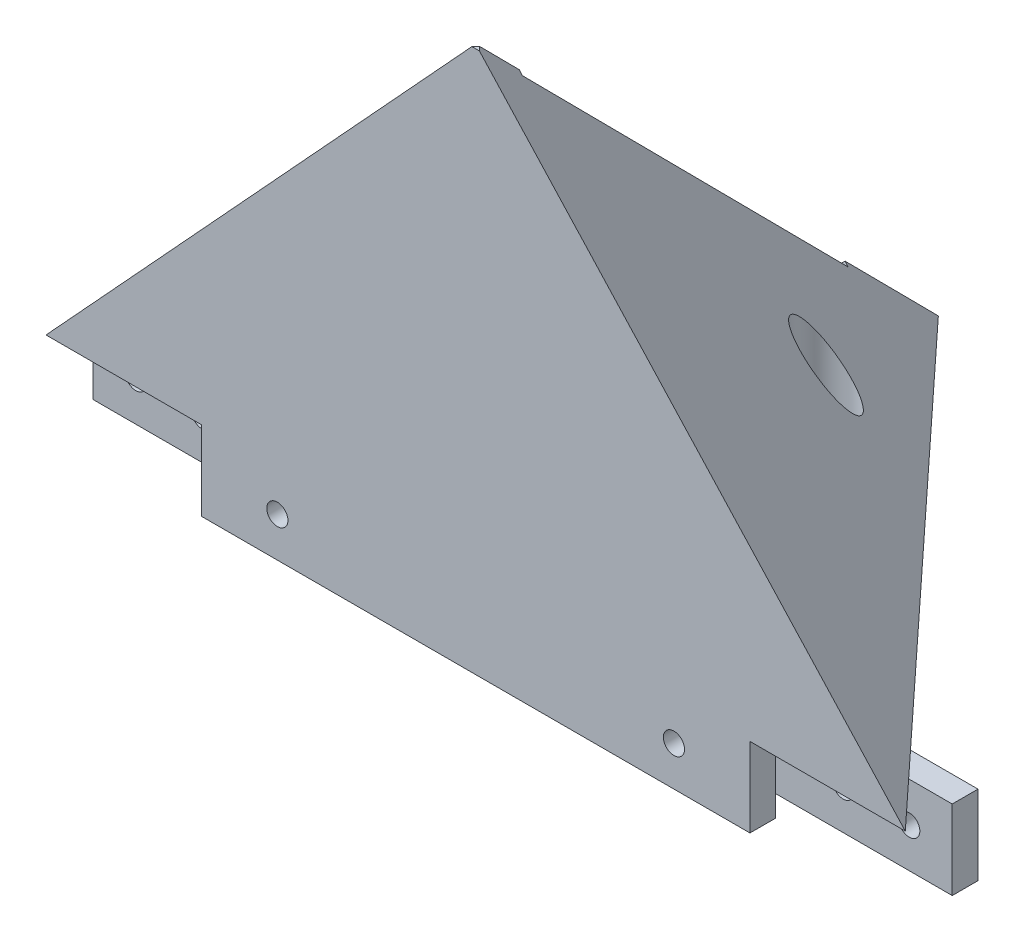
ISO-10303-21;
HEADER;
FILE_DESCRIPTION(('STEP AP214'),'2;1');
FILE_NAME('part.step','',(''),(''),'','','');
FILE_SCHEMA(('AUTOMOTIVE_DESIGN { 1 0 10303 214 1 1 1 1 }'));
ENDSEC;
DATA;
#1=APPLICATION_CONTEXT('core data for automotive mechanical design processes');
#2=APPLICATION_PROTOCOL_DEFINITION('international standard','automotive_design',2000,#1);
#3=PRODUCT_CONTEXT('',#1,'mechanical');
#4=PRODUCT('Part','Part','',(#3));
#5=PRODUCT_RELATED_PRODUCT_CATEGORY('part','',(#4));
#6=PRODUCT_DEFINITION_FORMATION('','',#4);
#7=PRODUCT_DEFINITION_CONTEXT('part definition',#1,'design');
#8=PRODUCT_DEFINITION('design','',#6,#7);
#9=PRODUCT_DEFINITION_SHAPE('','',#8);
#10=(LENGTH_UNIT() NAMED_UNIT(*) SI_UNIT(.MILLI.,.METRE.));
#11=(NAMED_UNIT(*) PLANE_ANGLE_UNIT() SI_UNIT($,.RADIAN.));
#12=(NAMED_UNIT(*) SI_UNIT($,.STERADIAN.) SOLID_ANGLE_UNIT());
#13=UNCERTAINTY_MEASURE_WITH_UNIT(LENGTH_MEASURE(1.E-05),#10,'distance_accuracy_value','');
#14=(GEOMETRIC_REPRESENTATION_CONTEXT(3) GLOBAL_UNCERTAINTY_ASSIGNED_CONTEXT((#13)) GLOBAL_UNIT_ASSIGNED_CONTEXT((#10,
#11,#12)) REPRESENTATION_CONTEXT('',''));
#15=CARTESIAN_POINT('',(0.,0.,0.));
#16=DIRECTION('',(0.,0.,1.));
#17=DIRECTION('',(1.,0.,0.));
#18=AXIS2_PLACEMENT_3D('',#15,#16,#17);
#19=CARTESIAN_POINT('',(0.,70.,70.));
#20=DIRECTION('',(0.,0.,-1.));
#21=DIRECTION('',(-1.,0.,0.));
#22=AXIS2_PLACEMENT_3D('',#19,#20,#21);
#23=PLANE('',#22);
#24=CARTESIAN_POINT('',(35.,-6.00000000000009,70.));
#25=DIRECTION('',(0.,0.,-1.));
#26=DIRECTION('',(-1.,0.,0.));
#27=AXIS2_PLACEMENT_3D('',#24,#25,#26);
#28=CIRCLE('',#27,1.60000000000001);
#29=CARTESIAN_POINT('',(33.4,-6.00000000000009,70.));
#30=VERTEX_POINT('',#29);
#31=EDGE_CURVE('E227',#30,#30,#28,.F.);
#32=ORIENTED_EDGE('',*,*,#31,.F.);
#33=EDGE_LOOP('',(#32));
#34=FACE_BOUND('',#33,.T.);
#35=CARTESIAN_POINT('',(95.,-6.00000000000002,70.));
#36=DIRECTION('',(0.,0.,-1.));
#37=DIRECTION('',(-1.,0.,0.));
#38=AXIS2_PLACEMENT_3D('',#35,#36,#37);
#39=CIRCLE('',#38,1.60000000000001);
#40=CARTESIAN_POINT('',(93.4,-6.00000000000002,70.));
#41=VERTEX_POINT('',#40);
#42=EDGE_CURVE('E218',#41,#41,#39,.T.);
#43=ORIENTED_EDGE('',*,*,#42,.T.);
#44=EDGE_LOOP('',(#43));
#45=FACE_BOUND('',#44,.T.);
#46=DIRECTION('',(0.,-1.,0.));
#47=VECTOR('',#46,1.);
#48=CARTESIAN_POINT('',(106.5,70.,70.));
#49=LINE('',#48,#47);
#50=CARTESIAN_POINT('',(106.5,0.,70.));
#51=VERTEX_POINT('',#50);
#52=CARTESIAN_POINT('',(106.5,-12.,70.));
#53=VERTEX_POINT('',#52);
#54=EDGE_CURVE('E58',#51,#53,#49,.T.);
#55=ORIENTED_EDGE('',*,*,#54,.F.);
#56=DIRECTION('',(1.,0.,0.));
#57=VECTOR('',#56,1.);
#58=CARTESIAN_POINT('',(0.,0.,70.));
#59=LINE('',#58,#57);
#60=CARTESIAN_POINT('',(130.,0.,70.));
#61=VERTEX_POINT('',#60);
#62=EDGE_CURVE('E183',#51,#61,#59,.T.);
#63=ORIENTED_EDGE('',*,*,#62,.T.);
#64=DIRECTION('',(0.6772405844057,-0.735761639958096,0.));
#65=VECTOR('',#64,1.);
#66=CARTESIAN_POINT('',(35.4947397964013,102.671556952075,70.));
#67=LINE('',#66,#65);
#68=CARTESIAN_POINT('',(65.5676643986237,70.,70.));
#69=VERTEX_POINT('',#68);
#70=EDGE_CURVE('E321',#69,#61,#67,.T.);
#71=ORIENTED_EDGE('',*,*,#70,.F.);
#72=DIRECTION('',(1.,0.,0.));
#73=VECTOR('',#72,1.);
#74=CARTESIAN_POINT('',(0.,70.,70.));
#75=LINE('',#74,#73);
#76=CARTESIAN_POINT('',(64.4323356013762,70.,70.));
#77=VERTEX_POINT('',#76);
#78=EDGE_CURVE('E319',#77,#69,#75,.T.);
#79=ORIENTED_EDGE('',*,*,#78,.F.);
#80=DIRECTION('',(-0.677240584405699,-0.735761639958096,0.));
#81=VECTOR('',#80,1.);
#82=CARTESIAN_POINT('',(16.0089377226769,17.3922864991323,70.));
#83=LINE('',#82,#81);
#84=CARTESIAN_POINT('',(0.,0.,70.));
#85=VERTEX_POINT('',#84);
#86=EDGE_CURVE('E180',#77,#85,#83,.T.);
#87=ORIENTED_EDGE('',*,*,#86,.T.);
#88=DIRECTION('',(1.,0.,0.));
#89=VECTOR('',#88,1.);
#90=CARTESIAN_POINT('',(0.,0.,70.));
#91=LINE('',#90,#89);
#92=CARTESIAN_POINT('',(23.5,0.,70.));
#93=VERTEX_POINT('',#92);
#94=EDGE_CURVE('E172',#85,#93,#91,.T.);
#95=ORIENTED_EDGE('',*,*,#94,.T.);
#96=DIRECTION('',(0.,-1.,0.));
#97=VECTOR('',#96,1.);
#98=CARTESIAN_POINT('',(23.4999999999999,70.0000000000001,70.));
#99=LINE('',#98,#97);
#100=CARTESIAN_POINT('',(23.5,-12.,70.));
#101=VERTEX_POINT('',#100);
#102=EDGE_CURVE('E158',#93,#101,#99,.T.);
#103=ORIENTED_EDGE('',*,*,#102,.T.);
#104=DIRECTION('',(-1.,0.,0.));
#105=VECTOR('',#104,1.);
#106=CARTESIAN_POINT('',(0.,-12.,70.));
#107=LINE('',#106,#105);
#108=EDGE_CURVE('E274',#53,#101,#107,.T.);
#109=ORIENTED_EDGE('',*,*,#108,.F.);
#110=EDGE_LOOP('',(#55,#63,#71,#79,#87,#95,#103,#109));
#111=FACE_BOUND('',#110,.T.);
#112=ADVANCED_FACE('F35',(#34,#45,#111),#23,.F.);
#113=CARTESIAN_POINT('',(0.,-12.,66.1));
#114=DIRECTION('',(0.,0.,1.));
#115=DIRECTION('',(1.,0.,0.));
#116=AXIS2_PLACEMENT_3D('',#113,#114,#115);
#117=PLANE('',#116);
#118=CARTESIAN_POINT('',(35.,-6.00000000000009,66.1));
#119=DIRECTION('',(0.,0.,1.));
#120=DIRECTION('',(1.,0.,0.));
#121=AXIS2_PLACEMENT_3D('',#118,#119,#120);
#122=CIRCLE('',#121,1.60000000000001);
#123=CARTESIAN_POINT('',(36.6,-6.00000000000009,66.1));
#124=VERTEX_POINT('',#123);
#125=EDGE_CURVE('E224',#124,#124,#122,.F.);
#126=ORIENTED_EDGE('',*,*,#125,.F.);
#127=EDGE_LOOP('',(#126));
#128=FACE_BOUND('',#127,.T.);
#129=CARTESIAN_POINT('',(95.,-6.00000000000002,66.1));
#130=DIRECTION('',(0.,0.,1.));
#131=DIRECTION('',(1.,0.,0.));
#132=AXIS2_PLACEMENT_3D('',#129,#130,#131);
#133=CIRCLE('',#132,1.60000000000001);
#134=CARTESIAN_POINT('',(96.6,-6.00000000000002,66.1));
#135=VERTEX_POINT('',#134);
#136=EDGE_CURVE('E215',#135,#135,#133,.T.);
#137=ORIENTED_EDGE('',*,*,#136,.T.);
#138=EDGE_LOOP('',(#137));
#139=FACE_BOUND('',#138,.T.);
#140=DIRECTION('',(0.,1.,0.));
#141=VECTOR('',#140,1.);
#142=CARTESIAN_POINT('',(106.5,-12.,66.1));
#143=LINE('',#142,#141);
#144=CARTESIAN_POINT('',(106.5,-12.,66.1));
#145=VERTEX_POINT('',#144);
#146=CARTESIAN_POINT('',(106.5,0.,66.1));
#147=VERTEX_POINT('',#146);
#148=EDGE_CURVE('E166',#145,#147,#143,.T.);
#149=ORIENTED_EDGE('',*,*,#148,.F.);
#150=DIRECTION('',(1.,0.,0.));
#151=VECTOR('',#150,1.);
#152=CARTESIAN_POINT('',(0.,-12.,66.1));
#153=LINE('',#152,#151);
#154=CARTESIAN_POINT('',(23.5,-12.,66.1));
#155=VERTEX_POINT('',#154);
#156=EDGE_CURVE('E276',#155,#145,#153,.T.);
#157=ORIENTED_EDGE('',*,*,#156,.F.);
#158=DIRECTION('',(0.,1.,0.));
#159=VECTOR('',#158,1.);
#160=CARTESIAN_POINT('',(23.5,-11.9999999999999,66.1));
#161=LINE('',#160,#159);
#162=CARTESIAN_POINT('',(23.5,0.,66.1));
#163=VERTEX_POINT('',#162);
#164=EDGE_CURVE('E50',#155,#163,#161,.T.);
#165=ORIENTED_EDGE('',*,*,#164,.T.);
#166=DIRECTION('',(1.,0.,0.));
#167=VECTOR('',#166,1.);
#168=CARTESIAN_POINT('',(0.,0.,66.1));
#169=LINE('',#168,#167);
#170=EDGE_CURVE('E176',#163,#147,#169,.T.);
#171=ORIENTED_EDGE('',*,*,#170,.T.);
#172=EDGE_LOOP('',(#149,#157,#165,#171));
#173=FACE_BOUND('',#172,.T.);
#174=ADVANCED_FACE('F391',(#128,#139,#173),#117,.F.);
#175=CARTESIAN_POINT('',(0.,-12.,0.));
#176=DIRECTION('',(0.,-1.,0.));
#177=DIRECTION('',(0.,0.,-1.));
#178=AXIS2_PLACEMENT_3D('',#175,#176,#177);
#179=PLANE('',#178);
#180=ORIENTED_EDGE('',*,*,#156,.T.);
#181=DIRECTION('',(0.,0.,1.));
#182=VECTOR('',#181,1.);
#183=CARTESIAN_POINT('',(106.5,-12.,0.));
#184=LINE('',#183,#182);
#185=EDGE_CURVE('E11',#145,#53,#184,.T.);
#186=ORIENTED_EDGE('',*,*,#185,.T.);
#187=ORIENTED_EDGE('',*,*,#108,.T.);
#188=DIRECTION('',(0.,0.,1.));
#189=VECTOR('',#188,1.);
#190=CARTESIAN_POINT('',(23.5,-12.,0.));
#191=LINE('',#190,#189);
#192=EDGE_CURVE('E43',#155,#101,#191,.T.);
#193=ORIENTED_EDGE('',*,*,#192,.F.);
#194=EDGE_LOOP('',(#180,#186,#187,#193));
#195=FACE_BOUND('',#194,.T.);
#196=ADVANCED_FACE('F393',(#195),#179,.T.);
#197=CARTESIAN_POINT('',(0.,-12.,62.9));
#198=DIRECTION('',(0.,0.,1.));
#199=DIRECTION('',(1.,0.,0.));
#200=AXIS2_PLACEMENT_3D('',#197,#198,#199);
#201=PLANE('',#200);
#202=CARTESIAN_POINT('',(16.5,-6.00000000000013,62.9));
#203=DIRECTION('',(0.,0.,1.));
#204=DIRECTION('',(1.,0.,0.));
#205=AXIS2_PLACEMENT_3D('',#202,#203,#204);
#206=CIRCLE('',#205,1.60000000000001);
#207=CARTESIAN_POINT('',(18.1,-6.00000000000013,62.9));
#208=VERTEX_POINT('',#207);
#209=EDGE_CURVE('E230',#208,#208,#206,.F.);
#210=ORIENTED_EDGE('',*,*,#209,.T.);
#211=EDGE_LOOP('',(#210));
#212=FACE_BOUND('',#211,.T.);
#213=DIRECTION('',(1.,0.,0.));
#214=VECTOR('',#213,1.);
#215=CARTESIAN_POINT('',(0.,0.,62.9));
#216=LINE('',#215,#214);
#217=CARTESIAN_POINT('',(0.,0.,62.9));
#218=VERTEX_POINT('',#217);
#219=CARTESIAN_POINT('',(6.59285714285715,0.,62.9));
#220=VERTEX_POINT('',#219);
#221=EDGE_CURVE('E249',#218,#220,#216,.T.);
#222=ORIENTED_EDGE('',*,*,#221,.F.);
#223=DIRECTION('',(0.,1.,0.));
#224=VECTOR('',#223,1.);
#225=CARTESIAN_POINT('',(0.,-12.,62.9));
#226=LINE('',#225,#224);
#227=CARTESIAN_POINT('',(0.,-12.,62.9));
#228=VERTEX_POINT('',#227);
#229=EDGE_CURVE('E270',#228,#218,#226,.T.);
#230=ORIENTED_EDGE('',*,*,#229,.F.);
#231=DIRECTION('',(1.,0.,0.));
#232=VECTOR('',#231,1.);
#233=CARTESIAN_POINT('',(0.,-12.,62.9));
#234=LINE('',#233,#232);
#235=CARTESIAN_POINT('',(130.,-12.,62.9));
#236=VERTEX_POINT('',#235);
#237=EDGE_CURVE('E237',#228,#236,#234,.T.);
#238=ORIENTED_EDGE('',*,*,#237,.T.);
#239=DIRECTION('',(0.,1.,0.));
#240=VECTOR('',#239,1.);
#241=CARTESIAN_POINT('',(130.,-12.,62.9));
#242=LINE('',#241,#240);
#243=CARTESIAN_POINT('',(130.,0.,62.9));
#244=VERTEX_POINT('',#243);
#245=EDGE_CURVE('E248',#236,#244,#242,.T.);
#246=ORIENTED_EDGE('',*,*,#245,.T.);
#247=CARTESIAN_POINT('',(123.407142857143,0.,62.9));
#248=VERTEX_POINT('',#247);
#249=EDGE_CURVE('E236',#248,#244,#216,.T.);
#250=ORIENTED_EDGE('',*,*,#249,.F.);
#251=EDGE_CURVE('E253',#220,#248,#216,.T.);
#252=ORIENTED_EDGE('',*,*,#251,.F.);
#253=EDGE_LOOP('',(#222,#230,#238,#246,#250,#252));
#254=FACE_BOUND('',#253,.T.);
#255=CARTESIAN_POINT('',(113.5,-6.00000000000002,62.9));
#256=DIRECTION('',(0.,0.,1.));
#257=DIRECTION('',(1.,0.,0.));
#258=AXIS2_PLACEMENT_3D('',#255,#256,#257);
#259=CIRCLE('',#258,1.60000000000001);
#260=CARTESIAN_POINT('',(115.1,-6.00000000000002,62.9));
#261=VERTEX_POINT('',#260);
#262=EDGE_CURVE('E206',#261,#261,#259,.T.);
#263=ORIENTED_EDGE('',*,*,#262,.F.);
#264=EDGE_LOOP('',(#263));
#265=FACE_BOUND('',#264,.T.);
#266=CARTESIAN_POINT('',(123.5,-6.00000000000002,62.9));
#267=DIRECTION('',(0.,0.,1.));
#268=DIRECTION('',(1.,0.,0.));
#269=AXIS2_PLACEMENT_3D('',#266,#267,#268);
#270=CIRCLE('',#269,1.60000000000001);
#271=CARTESIAN_POINT('',(125.1,-6.00000000000002,62.9));
#272=VERTEX_POINT('',#271);
#273=EDGE_CURVE('E209',#272,#272,#270,.T.);
#274=ORIENTED_EDGE('',*,*,#273,.F.);
#275=EDGE_LOOP('',(#274));
#276=FACE_BOUND('',#275,.T.);
#277=CARTESIAN_POINT('',(95.,-6.00000000000002,62.9));
#278=DIRECTION('',(0.,0.,1.));
#279=DIRECTION('',(1.,0.,0.));
#280=AXIS2_PLACEMENT_3D('',#277,#278,#279);
#281=CIRCLE('',#280,1.60000000000001);
#282=CARTESIAN_POINT('',(96.6,-6.00000000000002,62.9));
#283=VERTEX_POINT('',#282);
#284=EDGE_CURVE('E212',#283,#283,#281,.T.);
#285=ORIENTED_EDGE('',*,*,#284,.F.);
#286=EDGE_LOOP('',(#285));
#287=FACE_BOUND('',#286,.T.);
#288=CARTESIAN_POINT('',(35.,-6.00000000000009,62.9));
#289=DIRECTION('',(0.,0.,1.));
#290=DIRECTION('',(1.,0.,0.));
#291=AXIS2_PLACEMENT_3D('',#288,#289,#290);
#292=CIRCLE('',#291,1.60000000000001);
#293=CARTESIAN_POINT('',(36.6,-6.00000000000009,62.9));
#294=VERTEX_POINT('',#293);
#295=EDGE_CURVE('E221',#294,#294,#292,.F.);
#296=ORIENTED_EDGE('',*,*,#295,.T.);
#297=EDGE_LOOP('',(#296));
#298=FACE_BOUND('',#297,.T.);
#299=CARTESIAN_POINT('',(6.50000000000002,-6.00000000000015,62.9));
#300=DIRECTION('',(0.,0.,1.));
#301=DIRECTION('',(1.,0.,0.));
#302=AXIS2_PLACEMENT_3D('',#299,#300,#301);
#303=CIRCLE('',#302,1.60000000000001);
#304=CARTESIAN_POINT('',(8.10000000000003,-6.00000000000015,62.9));
#305=VERTEX_POINT('',#304);
#306=EDGE_CURVE('E233',#305,#305,#303,.F.);
#307=ORIENTED_EDGE('',*,*,#306,.T.);
#308=EDGE_LOOP('',(#307));
#309=FACE_BOUND('',#308,.T.);
#310=ADVANCED_FACE('F395',(#212,#254,#265,#276,#287,#298,#309),#201,.T.);
#311=CARTESIAN_POINT('',(0.,-12.,59.));
#312=DIRECTION('',(0.,0.,1.));
#313=DIRECTION('',(1.,0.,0.));
#314=AXIS2_PLACEMENT_3D('',#311,#312,#313);
#315=PLANE('',#314);
#316=CARTESIAN_POINT('',(95.,-6.00000000000002,59.));
#317=DIRECTION('',(0.,0.,-1.));
#318=DIRECTION('',(-1.,0.,0.));
#319=AXIS2_PLACEMENT_3D('',#316,#317,#318);
#320=CIRCLE('',#319,1.60000000000001);
#321=CARTESIAN_POINT('',(93.4,-6.00000000000002,59.));
#322=VERTEX_POINT('',#321);
#323=EDGE_CURVE('E196',#322,#322,#320,.T.);
#324=ORIENTED_EDGE('',*,*,#323,.F.);
#325=EDGE_LOOP('',(#324));
#326=FACE_BOUND('',#325,.T.);
#327=CARTESIAN_POINT('',(123.5,-6.00000000000002,59.));
#328=DIRECTION('',(0.,0.,-1.));
#329=DIRECTION('',(-1.,0.,0.));
#330=AXIS2_PLACEMENT_3D('',#327,#328,#329);
#331=CIRCLE('',#330,1.60000000000001);
#332=CARTESIAN_POINT('',(121.9,-6.00000000000002,59.));
#333=VERTEX_POINT('',#332);
#334=EDGE_CURVE('E192',#333,#333,#331,.T.);
#335=ORIENTED_EDGE('',*,*,#334,.F.);
#336=EDGE_LOOP('',(#335));
#337=FACE_BOUND('',#336,.T.);
#338=CARTESIAN_POINT('',(113.5,-6.00000000000002,59.));
#339=DIRECTION('',(0.,0.,-1.));
#340=DIRECTION('',(-1.,0.,0.));
#341=AXIS2_PLACEMENT_3D('',#338,#339,#340);
#342=CIRCLE('',#341,1.60000000000001);
#343=CARTESIAN_POINT('',(111.9,-6.00000000000002,59.));
#344=VERTEX_POINT('',#343);
#345=EDGE_CURVE('E195',#344,#344,#342,.T.);
#346=ORIENTED_EDGE('',*,*,#345,.F.);
#347=EDGE_LOOP('',(#346));
#348=FACE_BOUND('',#347,.T.);
#349=DIRECTION('',(1.,0.,0.));
#350=VECTOR('',#349,1.);
#351=CARTESIAN_POINT('',(0.,0.,59.));
#352=LINE('',#351,#350);
#353=CARTESIAN_POINT('',(0.,0.,59.));
#354=VERTEX_POINT('',#353);
#355=CARTESIAN_POINT('',(10.2142857142857,0.,59.));
#356=VERTEX_POINT('',#355);
#357=EDGE_CURVE('E256',#354,#356,#352,.T.);
#358=ORIENTED_EDGE('',*,*,#357,.T.);
#359=CARTESIAN_POINT('',(119.785714285714,0.,59.));
#360=VERTEX_POINT('',#359);
#361=EDGE_CURVE('E259',#356,#360,#352,.T.);
#362=ORIENTED_EDGE('',*,*,#361,.T.);
#363=CARTESIAN_POINT('',(130.,0.,59.));
#364=VERTEX_POINT('',#363);
#365=EDGE_CURVE('E255',#360,#364,#352,.T.);
#366=ORIENTED_EDGE('',*,*,#365,.T.);
#367=DIRECTION('',(0.,1.,0.));
#368=VECTOR('',#367,1.);
#369=CARTESIAN_POINT('',(130.,-12.,59.));
#370=LINE('',#369,#368);
#371=CARTESIAN_POINT('',(130.,-12.,59.));
#372=VERTEX_POINT('',#371);
#373=EDGE_CURVE('E264',#372,#364,#370,.T.);
#374=ORIENTED_EDGE('',*,*,#373,.F.);
#375=DIRECTION('',(1.,0.,0.));
#376=VECTOR('',#375,1.);
#377=CARTESIAN_POINT('',(0.,-12.,59.));
#378=LINE('',#377,#376);
#379=CARTESIAN_POINT('',(0.,-12.,59.));
#380=VERTEX_POINT('',#379);
#381=EDGE_CURVE('E243',#380,#372,#378,.T.);
#382=ORIENTED_EDGE('',*,*,#381,.F.);
#383=DIRECTION('',(0.,1.,0.));
#384=VECTOR('',#383,1.);
#385=CARTESIAN_POINT('',(0.,-12.,59.));
#386=LINE('',#385,#384);
#387=EDGE_CURVE('E267',#380,#354,#386,.T.);
#388=ORIENTED_EDGE('',*,*,#387,.T.);
#389=EDGE_LOOP('',(#358,#362,#366,#374,#382,#388));
#390=FACE_BOUND('',#389,.T.);
#391=CARTESIAN_POINT('',(35.,-6.00000000000009,59.));
#392=DIRECTION('',(0.,0.,1.));
#393=DIRECTION('',(1.,0.,0.));
#394=AXIS2_PLACEMENT_3D('',#391,#392,#393);
#395=CIRCLE('',#394,1.60000000000001);
#396=CARTESIAN_POINT('',(36.6,-6.00000000000009,59.));
#397=VERTEX_POINT('',#396);
#398=EDGE_CURVE('E199',#397,#397,#395,.T.);
#399=ORIENTED_EDGE('',*,*,#398,.T.);
#400=EDGE_LOOP('',(#399));
#401=FACE_BOUND('',#400,.T.);
#402=CARTESIAN_POINT('',(16.5,-6.00000000000013,59.));
#403=DIRECTION('',(0.,0.,1.));
#404=DIRECTION('',(1.,0.,0.));
#405=AXIS2_PLACEMENT_3D('',#402,#403,#404);
#406=CIRCLE('',#405,1.60000000000001);
#407=CARTESIAN_POINT('',(18.1,-6.00000000000013,59.));
#408=VERTEX_POINT('',#407);
#409=EDGE_CURVE('E186',#408,#408,#406,.T.);
#410=ORIENTED_EDGE('',*,*,#409,.T.);
#411=EDGE_LOOP('',(#410));
#412=FACE_BOUND('',#411,.T.);
#413=CARTESIAN_POINT('',(6.50000000000002,-6.00000000000015,59.));
#414=DIRECTION('',(0.,0.,1.));
#415=DIRECTION('',(1.,0.,0.));
#416=AXIS2_PLACEMENT_3D('',#413,#414,#415);
#417=CIRCLE('',#416,1.60000000000001);
#418=CARTESIAN_POINT('',(8.10000000000003,-6.00000000000015,59.));
#419=VERTEX_POINT('',#418);
#420=EDGE_CURVE('E182',#419,#419,#417,.T.);
#421=ORIENTED_EDGE('',*,*,#420,.T.);
#422=EDGE_LOOP('',(#421));
#423=FACE_BOUND('',#422,.T.);
#424=ADVANCED_FACE('F401',(#326,#337,#348,#390,#401,#412,#423),#315,.F.);
#425=CARTESIAN_POINT('',(0.,0.,0.));
#426=DIRECTION('',(0.,1.,0.));
#427=DIRECTION('',(0.,0.,1.));
#428=AXIS2_PLACEMENT_3D('',#425,#426,#427);
#429=PLANE('',#428);
#430=CARTESIAN_POINT('',(51.,0.,31.));
#431=DIRECTION('',(0.,-1.,0.));
#432=DIRECTION('',(0.,0.,-1.));
#433=AXIS2_PLACEMENT_3D('',#430,#431,#432);
#434=CIRCLE('',#433,4.);
#435=CARTESIAN_POINT('',(51.,0.,27.));
#436=VERTEX_POINT('',#435);
#437=EDGE_CURVE('E307',#436,#436,#434,.T.);
#438=ORIENTED_EDGE('',*,*,#437,.F.);
#439=EDGE_LOOP('',(#438));
#440=FACE_BOUND('',#439,.T.);
#441=CARTESIAN_POINT('',(79.,0.,31.));
#442=DIRECTION('',(0.,-1.,0.));
#443=DIRECTION('',(0.,0.,1.));
#444=AXIS2_PLACEMENT_3D('',#441,#442,#443);
#445=CIRCLE('',#444,3.99999999999999);
#446=CARTESIAN_POINT('',(79.,0.,35.));
#447=VERTEX_POINT('',#446);
#448=EDGE_CURVE('E306',#447,#447,#445,.T.);
#449=ORIENTED_EDGE('',*,*,#448,.F.);
#450=EDGE_LOOP('',(#449));
#451=FACE_BOUND('',#450,.T.);
#452=ORIENTED_EDGE('',*,*,#361,.F.);
#453=DIRECTION('',(0.680451099367278,0.,-0.732793491626299));
#454=VECTOR('',#453,1.);
#455=CARTESIAN_POINT('',(34.9041095890411,0.,32.4109589041096));
#456=LINE('',#455,#454);
#457=CARTESIAN_POINT('',(65.,0.,0.));
#458=VERTEX_POINT('',#457);
#459=EDGE_CURVE('E326',#356,#458,#456,.T.);
#460=ORIENTED_EDGE('',*,*,#459,.T.);
#461=DIRECTION('',(0.680451099367278,0.,0.732793491626299));
#462=VECTOR('',#461,1.);
#463=CARTESIAN_POINT('',(34.9041095890411,0.,-32.4109589041096));
#464=LINE('',#463,#462);
#465=EDGE_CURVE('E323',#458,#360,#464,.T.);
#466=ORIENTED_EDGE('',*,*,#465,.T.);
#467=EDGE_LOOP('',(#452,#460,#466));
#468=FACE_BOUND('',#467,.T.);
#469=ADVANCED_FACE('F424',(#440,#451,#468),#429,.F.);
#470=ORIENTED_EDGE('',*,*,#251,.T.);
#471=EDGE_CURVE('E318',#248,#61,#464,.T.);
#472=ORIENTED_EDGE('',*,*,#471,.T.);
#473=ORIENTED_EDGE('',*,*,#62,.F.);
#474=DIRECTION('',(0.,0.,-1.));
#475=VECTOR('',#474,1.);
#476=CARTESIAN_POINT('',(106.5,0.,135.));
#477=LINE('',#476,#475);
#478=EDGE_CURVE('E177',#51,#147,#477,.T.);
#479=ORIENTED_EDGE('',*,*,#478,.T.);
#480=ORIENTED_EDGE('',*,*,#170,.F.);
#481=DIRECTION('',(0.,0.,-1.));
#482=VECTOR('',#481,1.);
#483=CARTESIAN_POINT('',(23.5,0.,135.));
#484=LINE('',#483,#482);
#485=EDGE_CURVE('E161',#93,#163,#484,.T.);
#486=ORIENTED_EDGE('',*,*,#485,.F.);
#487=ORIENTED_EDGE('',*,*,#94,.F.);
#488=EDGE_CURVE('E327',#85,#220,#456,.T.);
#489=ORIENTED_EDGE('',*,*,#488,.T.);
#490=EDGE_LOOP('',(#470,#472,#473,#479,#480,#486,#487,#489));
#491=FACE_BOUND('',#490,.T.);
#492=ADVANCED_FACE('F171',(#491),#429,.F.);
#493=CARTESIAN_POINT('',(34.9041095890411,0.,-32.4109589041096));
#494=DIRECTION('',(0.607513337482,0.559192903470748,-0.564119527661857));
#495=DIRECTION('',(-0.680451099367278,0.,-0.732793491626299));
#496=AXIS2_PLACEMENT_3D('',#493,#494,#495);
#497=PLANE('',#496);
#498=CARTESIAN_POINT('',(79.,16.0633630666944,31.));
#499=DIRECTION('',(0.607513337482,0.559192903470748,-0.564119527661857));
#500=DIRECTION('',(0.409772920226977,-0.829037572555041,-0.38050342592505));
#501=AXIS2_PLACEMENT_3D('',#498,#499,#500);
#502=ELLIPSE('',#501,7.15316659988557,3.99999999999999);
#503=CARTESIAN_POINT('',(81.9311739665052,10.1331191926434,28.2781956025309));
#504=VERTEX_POINT('',#503);
#505=EDGE_CURVE('E310',#504,#504,#502,.T.);
#506=ORIENTED_EDGE('',*,*,#505,.F.);
#507=EDGE_LOOP('',(#506));
#508=FACE_BOUND('',#507,.T.);
#509=DIRECTION('',(0.,-0.710201180027229,-0.703998781169351));
#510=VECTOR('',#509,1.);
#511=CARTESIAN_POINT('',(65.,16.2048560312858,16.0633341873815));
#512=LINE('',#511,#510);
#513=CARTESIAN_POINT('',(65.,14.2040236005446,14.079975623387));
#514=VERTEX_POINT('',#513);
#515=EDGE_CURVE('E335',#514,#458,#512,.T.);
#516=ORIENTED_EDGE('',*,*,#515,.F.);
#517=DIRECTION('',(0.749540658424892,-0.638645075420444,0.174130034770557));
#518=VECTOR('',#517,1.);
#519=CARTESIAN_POINT('',(48.8232397388722,27.9874096796089,10.3218608432434));
#520=LINE('',#519,#518);
#521=CARTESIAN_POINT('',(65.5,13.7779992960308,14.196133454729));
#522=VERTEX_POINT('',#521);
#523=EDGE_CURVE('E303',#514,#522,#520,.T.);
#524=ORIENTED_EDGE('',*,*,#523,.T.);
#525=DIRECTION('',(0.,-0.710201180027229,-0.703998781169351));
#526=VECTOR('',#525,1.);
#527=CARTESIAN_POINT('',(65.5,-16.4740764432758,-15.7917418787057));
#528=LINE('',#527,#526);
#529=CARTESIAN_POINT('',(65.5,63.4920818979369,63.4760481365836));
#530=VERTEX_POINT('',#529);
#531=EDGE_CURVE('E281',#530,#522,#528,.T.);
#532=ORIENTED_EDGE('',*,*,#531,.F.);
#533=DIRECTION('',(-0.749540658424892,0.638645075420443,-0.174130034770557));
#534=VECTOR('',#533,1.);
#535=CARTESIAN_POINT('',(66.1890030466426,62.9050178104294,63.6361143359556));
#536=LINE('',#535,#534);
#537=CARTESIAN_POINT('',(65.,63.9181062024506,63.3598903052416));
#538=VERTEX_POINT('',#537);
#539=EDGE_CURVE('E300',#530,#538,#536,.T.);
#540=ORIENTED_EDGE('',*,*,#539,.T.);
#541=CARTESIAN_POINT('',(65.,70.,69.3886691091744));
#542=VERTEX_POINT('',#541);
#543=EDGE_CURVE('E331',#542,#538,#512,.T.);
#544=ORIENTED_EDGE('',*,*,#543,.F.);
#545=DIRECTION('',(0.680451099367278,0.,0.732793491626299));
#546=VECTOR('',#545,1.);
#547=CARTESIAN_POINT('',(0.304828005836325,70.,-0.283054576848019));
#548=LINE('',#547,#546);
#549=EDGE_CURVE('E329',#542,#69,#548,.T.);
#550=ORIENTED_EDGE('',*,*,#549,.T.);
#551=ORIENTED_EDGE('',*,*,#70,.T.);
#552=ORIENTED_EDGE('',*,*,#471,.F.);
#553=DIRECTION('',(-0.680451099367278,0.,-0.732793491626299));
#554=VECTOR('',#553,1.);
#555=CARTESIAN_POINT('',(34.9041095890411,0.,-32.4109589041096));
#556=LINE('',#555,#554);
#557=EDGE_CURVE('E272',#248,#360,#556,.T.);
#558=ORIENTED_EDGE('',*,*,#557,.T.);
#559=ORIENTED_EDGE('',*,*,#465,.F.);
#560=EDGE_LOOP('',(#516,#524,#532,#540,#544,#550,#551,#552,#558,#559));
#561=FACE_BOUND('',#560,.T.);
#562=ADVANCED_FACE('F364',(#508,#561),#497,.T.);
#563=CARTESIAN_POINT('',(34.9041095890411,0.,32.4109589041096));
#564=DIRECTION('',(-0.607513337482,0.559192903470748,-0.564119527661857));
#565=DIRECTION('',(-0.680451099367278,0.,0.732793491626299));
#566=AXIS2_PLACEMENT_3D('',#563,#564,#565);
#567=PLANE('',#566);
#568=CARTESIAN_POINT('',(51.,16.0633630666943,31.));
#569=DIRECTION('',(-0.607513337482,0.559192903470748,-0.564119527661857));
#570=DIRECTION('',(-0.409772920226977,-0.829037572555041,-0.38050342592505));
#571=AXIS2_PLACEMENT_3D('',#568,#569,#570);
#572=ELLIPSE('',#571,7.15316659988558,4.);
#573=CARTESIAN_POINT('',(48.0688260334948,10.1331191926434,28.2781956025309));
#574=VERTEX_POINT('',#573);
#575=EDGE_CURVE('E315',#574,#574,#572,.T.);
#576=ORIENTED_EDGE('',*,*,#575,.F.);
#577=EDGE_LOOP('',(#576));
#578=FACE_BOUND('',#577,.T.);
#579=DIRECTION('',(0.,-0.710201180027229,-0.703998781169351));
#580=VECTOR('',#579,1.);
#581=CARTESIAN_POINT('',(64.5,15.9356356192959,16.3349264960572));
#582=LINE('',#581,#580);
#583=CARTESIAN_POINT('',(64.5,63.4920818979369,63.4760481365836));
#584=VERTEX_POINT('',#583);
#585=CARTESIAN_POINT('',(64.5,13.7779992960309,14.196133454729));
#586=VERTEX_POINT('',#585);
#587=EDGE_CURVE('E334',#584,#586,#582,.T.);
#588=ORIENTED_EDGE('',*,*,#587,.T.);
#589=DIRECTION('',(0.749540658424892,0.638645075420444,-0.174130034770557));
#590=VECTOR('',#589,1.);
#591=CARTESIAN_POINT('',(38.8999464201463,-8.03449074771154,20.1434268668778));
#592=LINE('',#591,#590);
#593=EDGE_CURVE('E348',#586,#514,#592,.T.);
#594=ORIENTED_EDGE('',*,*,#593,.T.);
#595=ORIENTED_EDGE('',*,*,#515,.T.);
#596=ORIENTED_EDGE('',*,*,#459,.F.);
#597=EDGE_CURVE('E330',#220,#356,#456,.T.);
#598=ORIENTED_EDGE('',*,*,#597,.F.);
#599=ORIENTED_EDGE('',*,*,#488,.F.);
#600=ORIENTED_EDGE('',*,*,#86,.F.);
#601=DIRECTION('',(0.680451099367278,0.,-0.732793491626299));
#602=VECTOR('',#601,1.);
#603=CARTESIAN_POINT('',(69.5033911722459,70.,64.5388632313712));
#604=LINE('',#603,#602);
#605=EDGE_CURVE('E322',#77,#542,#604,.T.);
#606=ORIENTED_EDGE('',*,*,#605,.T.);
#607=ORIENTED_EDGE('',*,*,#543,.T.);
#608=DIRECTION('',(-0.749540658424892,-0.638645075420444,0.174130034770557));
#609=VECTOR('',#608,1.);
#610=CARTESIAN_POINT('',(21.5341831123759,26.8831173831089,73.45768035959));
#611=LINE('',#610,#609);
#612=EDGE_CURVE('E345',#538,#584,#611,.T.);
#613=ORIENTED_EDGE('',*,*,#612,.T.);
#614=EDGE_LOOP('',(#588,#594,#595,#596,#598,#599,#600,#606,#607,#613));
#615=FACE_BOUND('',#614,.T.);
#616=ADVANCED_FACE('F37',(#578,#615),#567,.T.);
#617=CARTESIAN_POINT('',(0.,70.,0.));
#618=DIRECTION('',(0.,1.,0.));
#619=DIRECTION('',(0.,0.,1.));
#620=AXIS2_PLACEMENT_3D('',#617,#618,#619);
#621=PLANE('',#620);
#622=ORIENTED_EDGE('',*,*,#549,.F.);
#623=ORIENTED_EDGE('',*,*,#605,.F.);
#624=ORIENTED_EDGE('',*,*,#78,.T.);
#625=EDGE_LOOP('',(#622,#623,#624));
#626=FACE_BOUND('',#625,.T.);
#627=ADVANCED_FACE('F382',(#626),#621,.T.);
#628=CARTESIAN_POINT('',(79.,70.,31.));
#629=DIRECTION('',(0.,-1.,0.));
#630=DIRECTION('',(0.,0.,-1.));
#631=AXIS2_PLACEMENT_3D('',#628,#629,#630);
#632=CYLINDRICAL_SURFACE('',#631,3.99999999999999);
#633=ORIENTED_EDGE('',*,*,#505,.T.);
#634=EDGE_LOOP('',(#633));
#635=FACE_BOUND('',#634,.T.);
#636=ORIENTED_EDGE('',*,*,#448,.T.);
#637=EDGE_LOOP('',(#636));
#638=FACE_BOUND('',#637,.T.);
#639=ADVANCED_FACE('F427',(#635,#638),#632,.F.);
#640=CARTESIAN_POINT('',(51.,70.,31.));
#641=DIRECTION('',(0.,-1.,0.));
#642=DIRECTION('',(0.,0.,-1.));
#643=AXIS2_PLACEMENT_3D('',#640,#641,#642);
#644=CYLINDRICAL_SURFACE('',#643,4.);
#645=ORIENTED_EDGE('',*,*,#575,.T.);
#646=EDGE_LOOP('',(#645));
#647=FACE_BOUND('',#646,.T.);
#648=ORIENTED_EDGE('',*,*,#437,.T.);
#649=EDGE_LOOP('',(#648));
#650=FACE_BOUND('',#649,.T.);
#651=ADVANCED_FACE('F430',(#647,#650),#644,.F.);
#652=CARTESIAN_POINT('',(65.5,14.2040236005446,14.079975623387));
#653=DIRECTION('',(0.,0.263052873116585,0.964781418739556));
#654=DIRECTION('',(0.,-0.964781418739556,0.263052873116585));
#655=AXIS2_PLACEMENT_3D('',#652,#653,#654);
#656=PLANE('',#655);
#657=ORIENTED_EDGE('',*,*,#593,.F.);
#658=DIRECTION('',(0.,0.964781418739556,-0.263052873116585));
#659=VECTOR('',#658,1.);
#660=CARTESIAN_POINT('',(64.5,14.2040236005446,14.079975623387));
#661=LINE('',#660,#659);
#662=CARTESIAN_POINT('',(64.5,3.0636873641759,17.1174485654863));
#663=VERTEX_POINT('',#662);
#664=EDGE_CURVE('E279',#663,#586,#661,.T.);
#665=ORIENTED_EDGE('',*,*,#664,.F.);
#666=DIRECTION('',(-1.,0.,0.));
#667=VECTOR('',#666,1.);
#668=CARTESIAN_POINT('',(65.5,3.0636873641759,17.1174485654863));
#669=LINE('',#668,#667);
#670=CARTESIAN_POINT('',(65.5,3.0636873641759,17.1174485654863));
#671=VERTEX_POINT('',#670);
#672=EDGE_CURVE('E290',#671,#663,#669,.T.);
#673=ORIENTED_EDGE('',*,*,#672,.F.);
#674=DIRECTION('',(0.,0.964781418739556,-0.263052873116585));
#675=VECTOR('',#674,1.);
#676=CARTESIAN_POINT('',(65.5,14.2040236005446,14.079975623387));
#677=LINE('',#676,#675);
#678=EDGE_CURVE('E282',#671,#522,#677,.T.);
#679=ORIENTED_EDGE('',*,*,#678,.T.);
#680=ORIENTED_EDGE('',*,*,#523,.F.);
#681=EDGE_LOOP('',(#657,#665,#673,#679,#680));
#682=FACE_BOUND('',#681,.T.);
#683=ADVANCED_FACE('F361',(#682),#656,.T.);
#684=CARTESIAN_POINT('',(65.5,63.9181062024506,63.3598903052416));
#685=DIRECTION('',(0.,-0.263052873116586,-0.964781418739555));
#686=DIRECTION('',(0.,0.964781418739555,-0.263052873116586));
#687=AXIS2_PLACEMENT_3D('',#684,#685,#686);
#688=PLANE('',#687);
#689=DIRECTION('',(0.,-0.964781418739555,0.263052873116586));
#690=VECTOR('',#689,1.);
#691=CARTESIAN_POINT('',(65.5,63.9181062024506,63.3598903052416));
#692=LINE('',#691,#690);
#693=CARTESIAN_POINT('',(65.5,52.7777699660819,66.3973632473409));
#694=VERTEX_POINT('',#693);
#695=EDGE_CURVE('E285',#530,#694,#692,.T.);
#696=ORIENTED_EDGE('',*,*,#695,.T.);
#697=DIRECTION('',(-1.,0.,0.));
#698=VECTOR('',#697,1.);
#699=CARTESIAN_POINT('',(65.5,52.7777699660819,66.3973632473409));
#700=LINE('',#699,#698);
#701=CARTESIAN_POINT('',(64.5,52.7777699660819,66.3973632473409));
#702=VERTEX_POINT('',#701);
#703=EDGE_CURVE('E297',#694,#702,#700,.T.);
#704=ORIENTED_EDGE('',*,*,#703,.T.);
#705=DIRECTION('',(0.,-0.964781418739555,0.263052873116586));
#706=VECTOR('',#705,1.);
#707=CARTESIAN_POINT('',(64.5,63.9181062024506,63.3598903052416));
#708=LINE('',#707,#706);
#709=EDGE_CURVE('E292',#584,#702,#708,.T.);
#710=ORIENTED_EDGE('',*,*,#709,.F.);
#711=ORIENTED_EDGE('',*,*,#612,.F.);
#712=ORIENTED_EDGE('',*,*,#539,.F.);
#713=EDGE_LOOP('',(#696,#704,#710,#711,#712));
#714=FACE_BOUND('',#713,.T.);
#715=ADVANCED_FACE('F378',(#714),#688,.T.);
#716=CARTESIAN_POINT('',(65.5,52.7777699660819,66.3973632473409));
#717=DIRECTION('',(0.,0.703998781169351,-0.710201180027229));
#718=DIRECTION('',(0.,0.710201180027229,0.703998781169351));
#719=AXIS2_PLACEMENT_3D('',#716,#717,#718);
#720=PLANE('',#719);
#721=DIRECTION('',(0.,-0.710201180027229,-0.703998781169351));
#722=VECTOR('',#721,1.);
#723=CARTESIAN_POINT('',(64.5,52.7777699660819,66.3973632473409));
#724=LINE('',#723,#722);
#725=EDGE_CURVE('E286',#702,#663,#724,.T.);
#726=ORIENTED_EDGE('',*,*,#725,.F.);
#727=ORIENTED_EDGE('',*,*,#703,.F.);
#728=DIRECTION('',(0.,-0.710201180027229,-0.703998781169351));
#729=VECTOR('',#728,1.);
#730=CARTESIAN_POINT('',(65.5,52.7777699660819,66.3973632473409));
#731=LINE('',#730,#729);
#732=EDGE_CURVE('E288',#694,#671,#731,.T.);
#733=ORIENTED_EDGE('',*,*,#732,.T.);
#734=ORIENTED_EDGE('',*,*,#672,.T.);
#735=EDGE_LOOP('',(#726,#727,#733,#734));
#736=FACE_BOUND('',#735,.T.);
#737=ADVANCED_FACE('F376',(#736),#720,.T.);
#738=CARTESIAN_POINT('',(65.5,0.,0.));
#739=DIRECTION('',(1.,0.,0.));
#740=DIRECTION('',(0.,0.,-1.));
#741=AXIS2_PLACEMENT_3D('',#738,#739,#740);
#742=PLANE('',#741);
#743=ORIENTED_EDGE('',*,*,#531,.T.);
#744=ORIENTED_EDGE('',*,*,#678,.F.);
#745=ORIENTED_EDGE('',*,*,#732,.F.);
#746=ORIENTED_EDGE('',*,*,#695,.F.);
#747=EDGE_LOOP('',(#743,#744,#745,#746));
#748=FACE_BOUND('',#747,.T.);
#749=ADVANCED_FACE('F355',(#748),#742,.F.);
#750=CARTESIAN_POINT('',(64.5,0.,0.));
#751=DIRECTION('',(1.,0.,0.));
#752=DIRECTION('',(0.,0.,-1.));
#753=AXIS2_PLACEMENT_3D('',#750,#751,#752);
#754=PLANE('',#753);
#755=ORIENTED_EDGE('',*,*,#709,.T.);
#756=ORIENTED_EDGE('',*,*,#725,.T.);
#757=ORIENTED_EDGE('',*,*,#664,.T.);
#758=ORIENTED_EDGE('',*,*,#587,.F.);
#759=EDGE_LOOP('',(#755,#756,#757,#758));
#760=FACE_BOUND('',#759,.T.);
#761=ADVANCED_FACE('F371',(#760),#754,.T.);
#762=CARTESIAN_POINT('',(0.,0.,0.));
#763=DIRECTION('',(0.,-1.,0.));
#764=DIRECTION('',(0.,0.,-1.));
#765=AXIS2_PLACEMENT_3D('',#762,#763,#764);
#766=PLANE('',#765);
#767=ORIENTED_EDGE('',*,*,#557,.F.);
#768=ORIENTED_EDGE('',*,*,#249,.T.);
#769=DIRECTION('',(0.,0.,-1.));
#770=VECTOR('',#769,1.);
#771=CARTESIAN_POINT('',(130.,0.,0.));
#772=LINE('',#771,#770);
#773=EDGE_CURVE('E241',#244,#364,#772,.T.);
#774=ORIENTED_EDGE('',*,*,#773,.T.);
#775=ORIENTED_EDGE('',*,*,#365,.F.);
#776=EDGE_LOOP('',(#767,#768,#774,#775));
#777=FACE_BOUND('',#776,.T.);
#778=ADVANCED_FACE('F460',(#777),#766,.F.);
#779=CARTESIAN_POINT('',(0.,-12.,0.));
#780=DIRECTION('',(1.,0.,0.));
#781=DIRECTION('',(0.,0.,-1.));
#782=AXIS2_PLACEMENT_3D('',#779,#780,#781);
#783=PLANE('',#782);
#784=DIRECTION('',(0.,0.,-1.));
#785=VECTOR('',#784,1.);
#786=CARTESIAN_POINT('',(0.,0.,0.));
#787=LINE('',#786,#785);
#788=EDGE_CURVE('E252',#218,#354,#787,.T.);
#789=ORIENTED_EDGE('',*,*,#788,.T.);
#790=ORIENTED_EDGE('',*,*,#387,.F.);
#791=DIRECTION('',(0.,0.,-1.));
#792=VECTOR('',#791,1.);
#793=CARTESIAN_POINT('',(0.,-12.,0.));
#794=LINE('',#793,#792);
#795=EDGE_CURVE('E240',#228,#380,#794,.T.);
#796=ORIENTED_EDGE('',*,*,#795,.F.);
#797=ORIENTED_EDGE('',*,*,#229,.T.);
#798=EDGE_LOOP('',(#789,#790,#796,#797));
#799=FACE_BOUND('',#798,.T.);
#800=ADVANCED_FACE('F453',(#799),#783,.F.);
#801=CARTESIAN_POINT('',(130.,-12.,0.));
#802=DIRECTION('',(1.,0.,0.));
#803=DIRECTION('',(0.,0.,-1.));
#804=AXIS2_PLACEMENT_3D('',#801,#802,#803);
#805=PLANE('',#804);
#806=ORIENTED_EDGE('',*,*,#773,.F.);
#807=ORIENTED_EDGE('',*,*,#245,.F.);
#808=DIRECTION('',(0.,0.,-1.));
#809=VECTOR('',#808,1.);
#810=CARTESIAN_POINT('',(130.,-12.,0.));
#811=LINE('',#810,#809);
#812=EDGE_CURVE('E245',#236,#372,#811,.T.);
#813=ORIENTED_EDGE('',*,*,#812,.T.);
#814=ORIENTED_EDGE('',*,*,#373,.T.);
#815=EDGE_LOOP('',(#806,#807,#813,#814));
#816=FACE_BOUND('',#815,.T.);
#817=ADVANCED_FACE('F464',(#816),#805,.T.);
#818=CARTESIAN_POINT('',(0.,-12.,0.));
#819=DIRECTION('',(0.,-1.,0.));
#820=DIRECTION('',(0.,0.,-1.));
#821=AXIS2_PLACEMENT_3D('',#818,#819,#820);
#822=PLANE('',#821);
#823=ORIENTED_EDGE('',*,*,#237,.F.);
#824=ORIENTED_EDGE('',*,*,#795,.T.);
#825=ORIENTED_EDGE('',*,*,#381,.T.);
#826=ORIENTED_EDGE('',*,*,#812,.F.);
#827=EDGE_LOOP('',(#823,#824,#825,#826));
#828=FACE_BOUND('',#827,.T.);
#829=ADVANCED_FACE('F466',(#828),#822,.T.);
#830=ORIENTED_EDGE('',*,*,#597,.T.);
#831=ORIENTED_EDGE('',*,*,#357,.F.);
#832=ORIENTED_EDGE('',*,*,#788,.F.);
#833=ORIENTED_EDGE('',*,*,#221,.T.);
#834=EDGE_LOOP('',(#830,#831,#832,#833));
#835=FACE_BOUND('',#834,.T.);
#836=ADVANCED_FACE('F443',(#835),#766,.F.);
#837=CARTESIAN_POINT('',(113.5,-6.00000000000002,129.));
#838=DIRECTION('',(0.,0.,-1.));
#839=DIRECTION('',(-1.,0.,0.));
#840=AXIS2_PLACEMENT_3D('',#837,#838,#839);
#841=CYLINDRICAL_SURFACE('',#840,1.60000000000001);
#842=ORIENTED_EDGE('',*,*,#262,.T.);
#843=EDGE_LOOP('',(#842));
#844=FACE_BOUND('',#843,.T.);
#845=ORIENTED_EDGE('',*,*,#345,.T.);
#846=EDGE_LOOP('',(#845));
#847=FACE_BOUND('',#846,.T.);
#848=ADVANCED_FACE('F473',(#844,#847),#841,.F.);
#849=CARTESIAN_POINT('',(123.5,-6.00000000000002,129.));
#850=DIRECTION('',(0.,0.,-1.));
#851=DIRECTION('',(-1.,0.,0.));
#852=AXIS2_PLACEMENT_3D('',#849,#850,#851);
#853=CYLINDRICAL_SURFACE('',#852,1.60000000000001);
#854=ORIENTED_EDGE('',*,*,#273,.T.);
#855=EDGE_LOOP('',(#854));
#856=FACE_BOUND('',#855,.T.);
#857=ORIENTED_EDGE('',*,*,#334,.T.);
#858=EDGE_LOOP('',(#857));
#859=FACE_BOUND('',#858,.T.);
#860=ADVANCED_FACE('F591',(#856,#859),#853,.F.);
#861=CARTESIAN_POINT('',(95.,-6.00000000000002,129.));
#862=DIRECTION('',(0.,0.,-1.));
#863=DIRECTION('',(-1.,0.,0.));
#864=AXIS2_PLACEMENT_3D('',#861,#862,#863);
#865=CYLINDRICAL_SURFACE('',#864,1.60000000000001);
#866=ORIENTED_EDGE('',*,*,#284,.T.);
#867=EDGE_LOOP('',(#866));
#868=FACE_BOUND('',#867,.T.);
#869=ORIENTED_EDGE('',*,*,#323,.T.);
#870=EDGE_LOOP('',(#869));
#871=FACE_BOUND('',#870,.T.);
#872=ADVANCED_FACE('F600',(#868,#871),#865,.F.);
#873=CARTESIAN_POINT('',(35.,-6.00000000000009,129.));
#874=DIRECTION('',(0.,0.,-1.));
#875=DIRECTION('',(-1.,0.,0.));
#876=AXIS2_PLACEMENT_3D('',#873,#874,#875);
#877=CYLINDRICAL_SURFACE('',#876,1.60000000000001);
#878=ORIENTED_EDGE('',*,*,#295,.F.);
#879=EDGE_LOOP('',(#878));
#880=FACE_BOUND('',#879,.T.);
#881=ORIENTED_EDGE('',*,*,#398,.F.);
#882=EDGE_LOOP('',(#881));
#883=FACE_BOUND('',#882,.T.);
#884=ADVANCED_FACE('F610',(#880,#883),#877,.F.);
#885=CARTESIAN_POINT('',(16.5,-6.00000000000013,129.));
#886=DIRECTION('',(0.,0.,-1.));
#887=DIRECTION('',(-1.,0.,0.));
#888=AXIS2_PLACEMENT_3D('',#885,#886,#887);
#889=CYLINDRICAL_SURFACE('',#888,1.60000000000001);
#890=ORIENTED_EDGE('',*,*,#209,.F.);
#891=EDGE_LOOP('',(#890));
#892=FACE_BOUND('',#891,.T.);
#893=ORIENTED_EDGE('',*,*,#409,.F.);
#894=EDGE_LOOP('',(#893));
#895=FACE_BOUND('',#894,.T.);
#896=ADVANCED_FACE('F621',(#892,#895),#889,.F.);
#897=CARTESIAN_POINT('',(6.50000000000002,-6.00000000000015,129.));
#898=DIRECTION('',(0.,0.,-1.));
#899=DIRECTION('',(-1.,0.,0.));
#900=AXIS2_PLACEMENT_3D('',#897,#898,#899);
#901=CYLINDRICAL_SURFACE('',#900,1.60000000000001);
#902=ORIENTED_EDGE('',*,*,#306,.F.);
#903=EDGE_LOOP('',(#902));
#904=FACE_BOUND('',#903,.T.);
#905=ORIENTED_EDGE('',*,*,#420,.F.);
#906=EDGE_LOOP('',(#905));
#907=FACE_BOUND('',#906,.T.);
#908=ADVANCED_FACE('F632',(#904,#907),#901,.F.);
#909=ORIENTED_EDGE('',*,*,#136,.F.);
#910=EDGE_LOOP('',(#909));
#911=FACE_BOUND('',#910,.T.);
#912=ORIENTED_EDGE('',*,*,#42,.F.);
#913=EDGE_LOOP('',(#912));
#914=FACE_BOUND('',#913,.T.);
#915=ADVANCED_FACE('F613',(#911,#914),#865,.F.);
#916=ORIENTED_EDGE('',*,*,#125,.T.);
#917=EDGE_LOOP('',(#916));
#918=FACE_BOUND('',#917,.T.);
#919=ORIENTED_EDGE('',*,*,#31,.T.);
#920=EDGE_LOOP('',(#919));
#921=FACE_BOUND('',#920,.T.);
#922=ADVANCED_FACE('F624',(#918,#921),#877,.F.);
#923=CARTESIAN_POINT('',(23.5,0.,135.));
#924=DIRECTION('',(1.,0.,0.));
#925=DIRECTION('',(0.,1.,0.));
#926=AXIS2_PLACEMENT_3D('',#923,#924,#925);
#927=PLANE('',#926);
#928=ORIENTED_EDGE('',*,*,#485,.T.);
#929=ORIENTED_EDGE('',*,*,#164,.F.);
#930=ORIENTED_EDGE('',*,*,#192,.T.);
#931=ORIENTED_EDGE('',*,*,#102,.F.);
#932=EDGE_LOOP('',(#928,#929,#930,#931));
#933=FACE_BOUND('',#932,.T.);
#934=ADVANCED_FACE('F160',(#933),#927,.F.);
#935=CARTESIAN_POINT('',(106.5,0.,135.));
#936=DIRECTION('',(1.,0.,0.));
#937=DIRECTION('',(0.,0.,-1.));
#938=AXIS2_PLACEMENT_3D('',#935,#936,#937);
#939=PLANE('',#938);
#940=ORIENTED_EDGE('',*,*,#54,.T.);
#941=ORIENTED_EDGE('',*,*,#185,.F.);
#942=ORIENTED_EDGE('',*,*,#148,.T.);
#943=ORIENTED_EDGE('',*,*,#478,.F.);
#944=EDGE_LOOP('',(#940,#941,#942,#943));
#945=FACE_BOUND('',#944,.T.);
#946=ADVANCED_FACE('F384',(#945),#939,.T.);
#947=CLOSED_SHELL('',(#112,#174,#196,#310,#424,#469,#492,#562,#616,#627,#639,#651,#683,#715,
#737,#749,#761,#778,#800,#817,#829,#836,#848,#860,#872,#884,#896,#908,#915,#922,#934,#946));
#948=MANIFOLD_SOLID_BREP('B2',#947);
#949=ADVANCED_BREP_SHAPE_REPRESENTATION('',(#18,#948),#14);
#950=SHAPE_DEFINITION_REPRESENTATION(#9,#949);
ENDSEC;
END-ISO-10303-21;
